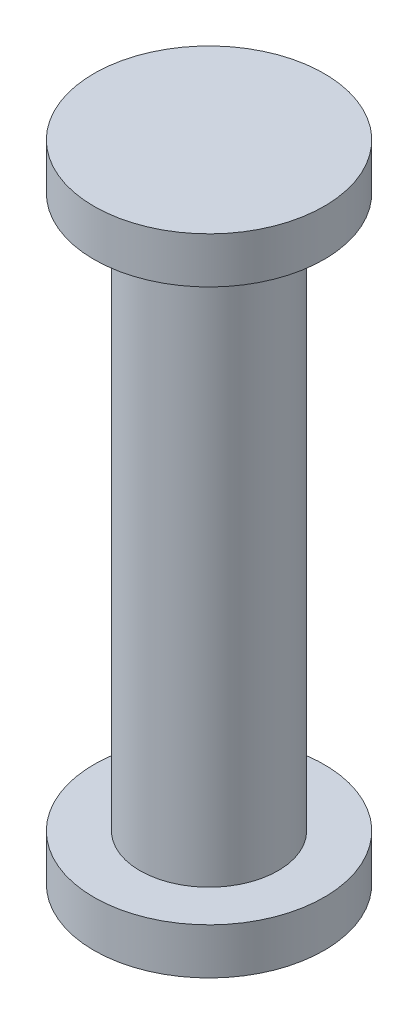
ISO-10303-21;
HEADER;
FILE_DESCRIPTION(('STEP AP214'),'2;1');
FILE_NAME('part.step','',(''),(''),'','','');
FILE_SCHEMA(('AUTOMOTIVE_DESIGN { 1 0 10303 214 1 1 1 1 }'));
ENDSEC;
DATA;
#1=APPLICATION_CONTEXT('core data for automotive mechanical design processes');
#2=APPLICATION_PROTOCOL_DEFINITION('international standard','automotive_design',2000,#1);
#3=PRODUCT_CONTEXT('',#1,'mechanical');
#4=PRODUCT('Part','Part','',(#3));
#5=PRODUCT_RELATED_PRODUCT_CATEGORY('part','',(#4));
#6=PRODUCT_DEFINITION_FORMATION('','',#4);
#7=PRODUCT_DEFINITION_CONTEXT('part definition',#1,'design');
#8=PRODUCT_DEFINITION('design','',#6,#7);
#9=PRODUCT_DEFINITION_SHAPE('','',#8);
#10=(LENGTH_UNIT() NAMED_UNIT(*) SI_UNIT(.MILLI.,.METRE.));
#11=(NAMED_UNIT(*) PLANE_ANGLE_UNIT() SI_UNIT($,.RADIAN.));
#12=(NAMED_UNIT(*) SI_UNIT($,.STERADIAN.) SOLID_ANGLE_UNIT());
#13=UNCERTAINTY_MEASURE_WITH_UNIT(LENGTH_MEASURE(1.E-05),#10,'distance_accuracy_value','');
#14=(GEOMETRIC_REPRESENTATION_CONTEXT(3) GLOBAL_UNCERTAINTY_ASSIGNED_CONTEXT((#13)) GLOBAL_UNIT_ASSIGNED_CONTEXT((#10,
#11,#12)) REPRESENTATION_CONTEXT('',''));
#15=CARTESIAN_POINT('',(0.,0.,0.));
#16=DIRECTION('',(0.,0.,1.));
#17=DIRECTION('',(1.,0.,0.));
#18=AXIS2_PLACEMENT_3D('',#15,#16,#17);
#19=CARTESIAN_POINT('',(0.,1.,0.));
#20=DIRECTION('',(0.,-1.,0.));
#21=DIRECTION('',(0.,0.,-1.));
#22=AXIS2_PLACEMENT_3D('',#19,#20,#21);
#23=CYLINDRICAL_SURFACE('',#22,2.5);
#24=CARTESIAN_POINT('',(0.,1.,0.));
#25=DIRECTION('',(0.,1.,0.));
#26=DIRECTION('',(0.,0.,1.));
#27=AXIS2_PLACEMENT_3D('',#24,#25,#26);
#28=CIRCLE('',#27,2.5);
#29=CARTESIAN_POINT('',(0.,1.,2.5));
#30=VERTEX_POINT('',#29);
#31=EDGE_CURVE('E39',#30,#30,#28,.T.);
#32=ORIENTED_EDGE('',*,*,#31,.F.);
#33=EDGE_LOOP('',(#32));
#34=FACE_BOUND('',#33,.T.);
#35=CARTESIAN_POINT('',(0.,0.,0.));
#36=DIRECTION('',(0.,1.,0.));
#37=DIRECTION('',(0.,0.,1.));
#38=AXIS2_PLACEMENT_3D('',#35,#36,#37);
#39=CIRCLE('',#38,2.5);
#40=CARTESIAN_POINT('',(0.,0.,2.5));
#41=VERTEX_POINT('',#40);
#42=EDGE_CURVE('E35',#41,#41,#39,.T.);
#43=ORIENTED_EDGE('',*,*,#42,.T.);
#44=EDGE_LOOP('',(#43));
#45=FACE_BOUND('',#44,.T.);
#46=ADVANCED_FACE('F32',(#34,#45),#23,.T.);
#47=CARTESIAN_POINT('',(0.,1.,0.));
#48=DIRECTION('',(0.,1.,0.));
#49=DIRECTION('',(0.,0.,1.));
#50=AXIS2_PLACEMENT_3D('',#47,#48,#49);
#51=PLANE('',#50);
#52=CARTESIAN_POINT('',(0.,1.,0.));
#53=DIRECTION('',(0.,1.,0.));
#54=DIRECTION('',(0.,0.,1.));
#55=AXIS2_PLACEMENT_3D('',#52,#53,#54);
#56=CIRCLE('',#55,1.5);
#57=CARTESIAN_POINT('',(0.,1.,1.5));
#58=VERTEX_POINT('',#57);
#59=EDGE_CURVE('E10',#58,#58,#56,.T.);
#60=ORIENTED_EDGE('',*,*,#59,.F.);
#61=EDGE_LOOP('',(#60));
#62=FACE_BOUND('',#61,.T.);
#63=ORIENTED_EDGE('',*,*,#31,.T.);
#64=EDGE_LOOP('',(#63));
#65=FACE_BOUND('',#64,.T.);
#66=ADVANCED_FACE('F73',(#62,#65),#51,.T.);
#67=CARTESIAN_POINT('',(0.,0.,0.));
#68=DIRECTION('',(0.,1.,0.));
#69=DIRECTION('',(0.,0.,1.));
#70=AXIS2_PLACEMENT_3D('',#67,#68,#69);
#71=PLANE('',#70);
#72=ORIENTED_EDGE('',*,*,#42,.F.);
#73=EDGE_LOOP('',(#72));
#74=FACE_BOUND('',#73,.T.);
#75=ADVANCED_FACE('F78',(#74),#71,.F.);
#76=CARTESIAN_POINT('',(0.,13.,0.));
#77=DIRECTION('',(0.,-1.,0.));
#78=DIRECTION('',(0.,0.,-1.));
#79=AXIS2_PLACEMENT_3D('',#76,#77,#78);
#80=CYLINDRICAL_SURFACE('',#79,1.5);
#81=CARTESIAN_POINT('',(0.,13.,0.));
#82=DIRECTION('',(0.,1.,0.));
#83=DIRECTION('',(0.,0.,1.));
#84=AXIS2_PLACEMENT_3D('',#81,#82,#83);
#85=CIRCLE('',#84,1.5);
#86=CARTESIAN_POINT('',(0.,13.,1.5));
#87=VERTEX_POINT('',#86);
#88=EDGE_CURVE('E45',#87,#87,#85,.T.);
#89=ORIENTED_EDGE('',*,*,#88,.F.);
#90=EDGE_LOOP('',(#89));
#91=FACE_BOUND('',#90,.T.);
#92=ORIENTED_EDGE('',*,*,#59,.T.);
#93=EDGE_LOOP('',(#92));
#94=FACE_BOUND('',#93,.T.);
#95=ADVANCED_FACE('F60',(#91,#94),#80,.T.);
#96=CARTESIAN_POINT('',(0.,14.,0.));
#97=DIRECTION('',(0.,-1.,0.));
#98=DIRECTION('',(0.,0.,-1.));
#99=AXIS2_PLACEMENT_3D('',#96,#97,#98);
#100=CYLINDRICAL_SURFACE('',#99,2.5);
#101=CARTESIAN_POINT('',(0.,14.,0.));
#102=DIRECTION('',(0.,1.,0.));
#103=DIRECTION('',(0.,0.,1.));
#104=AXIS2_PLACEMENT_3D('',#101,#102,#103);
#105=CIRCLE('',#104,2.5);
#106=CARTESIAN_POINT('',(0.,14.,2.5));
#107=VERTEX_POINT('',#106);
#108=EDGE_CURVE('E48',#107,#107,#105,.T.);
#109=ORIENTED_EDGE('',*,*,#108,.F.);
#110=EDGE_LOOP('',(#109));
#111=FACE_BOUND('',#110,.T.);
#112=CARTESIAN_POINT('',(0.,13.,0.));
#113=DIRECTION('',(0.,1.,0.));
#114=DIRECTION('',(0.,0.,1.));
#115=AXIS2_PLACEMENT_3D('',#112,#113,#114);
#116=CIRCLE('',#115,2.5);
#117=CARTESIAN_POINT('',(0.,13.,2.5));
#118=VERTEX_POINT('',#117);
#119=EDGE_CURVE('E49',#118,#118,#116,.T.);
#120=ORIENTED_EDGE('',*,*,#119,.T.);
#121=EDGE_LOOP('',(#120));
#122=FACE_BOUND('',#121,.T.);
#123=ADVANCED_FACE('F57',(#111,#122),#100,.T.);
#124=CARTESIAN_POINT('',(0.,14.,0.));
#125=DIRECTION('',(0.,1.,0.));
#126=DIRECTION('',(0.,0.,1.));
#127=AXIS2_PLACEMENT_3D('',#124,#125,#126);
#128=PLANE('',#127);
#129=ORIENTED_EDGE('',*,*,#108,.T.);
#130=EDGE_LOOP('',(#129));
#131=FACE_BOUND('',#130,.T.);
#132=ADVANCED_FACE('F55',(#131),#128,.T.);
#133=CARTESIAN_POINT('',(0.,13.,0.));
#134=DIRECTION('',(0.,1.,0.));
#135=DIRECTION('',(0.,0.,1.));
#136=AXIS2_PLACEMENT_3D('',#133,#134,#135);
#137=PLANE('',#136);
#138=ORIENTED_EDGE('',*,*,#88,.T.);
#139=EDGE_LOOP('',(#138));
#140=FACE_BOUND('',#139,.T.);
#141=ORIENTED_EDGE('',*,*,#119,.F.);
#142=EDGE_LOOP('',(#141));
#143=FACE_BOUND('',#142,.T.);
#144=ADVANCED_FACE('F64',(#140,#143),#137,.F.);
#145=CLOSED_SHELL('',(#46,#66,#75,#95,#123,#132,#144));
#146=MANIFOLD_SOLID_BREP('B2',#145);
#147=ADVANCED_BREP_SHAPE_REPRESENTATION('',(#18,#146),#14);
#148=SHAPE_DEFINITION_REPRESENTATION(#9,#147);
ENDSEC;
END-ISO-10303-21;
